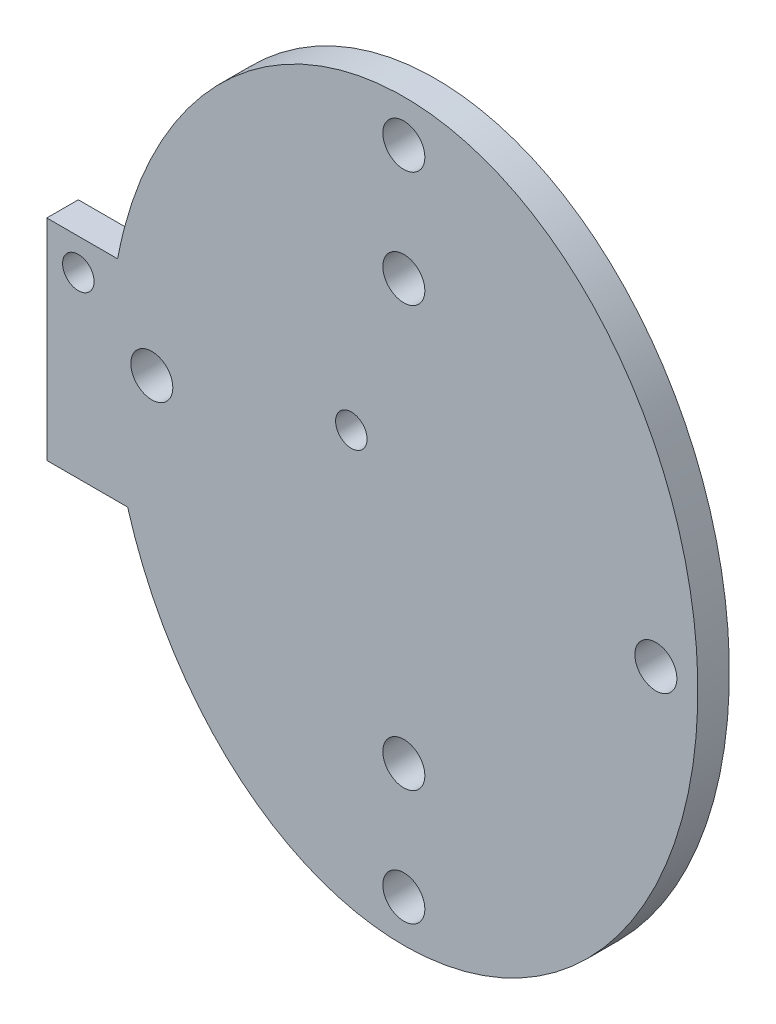
ISO-10303-21;
HEADER;
FILE_DESCRIPTION(('STEP AP214'),'2;1');
FILE_NAME('part.step','',(''),(''),'','','');
FILE_SCHEMA(('AUTOMOTIVE_DESIGN { 1 0 10303 214 1 1 1 1 }'));
ENDSEC;
DATA;
#1=APPLICATION_CONTEXT('core data for automotive mechanical design processes');
#2=APPLICATION_PROTOCOL_DEFINITION('international standard','automotive_design',2000,#1);
#3=PRODUCT_CONTEXT('',#1,'mechanical');
#4=PRODUCT('Part','Part','',(#3));
#5=PRODUCT_RELATED_PRODUCT_CATEGORY('part','',(#4));
#6=PRODUCT_DEFINITION_FORMATION('','',#4);
#7=PRODUCT_DEFINITION_CONTEXT('part definition',#1,'design');
#8=PRODUCT_DEFINITION('design','',#6,#7);
#9=PRODUCT_DEFINITION_SHAPE('','',#8);
#10=(LENGTH_UNIT() NAMED_UNIT(*) SI_UNIT(.MILLI.,.METRE.));
#11=(NAMED_UNIT(*) PLANE_ANGLE_UNIT() SI_UNIT($,.RADIAN.));
#12=(NAMED_UNIT(*) SI_UNIT($,.STERADIAN.) SOLID_ANGLE_UNIT());
#13=UNCERTAINTY_MEASURE_WITH_UNIT(LENGTH_MEASURE(1.E-05),#10,'distance_accuracy_value','');
#14=(GEOMETRIC_REPRESENTATION_CONTEXT(3) GLOBAL_UNCERTAINTY_ASSIGNED_CONTEXT((#13)) GLOBAL_UNIT_ASSIGNED_CONTEXT((#10,
#11,#12)) REPRESENTATION_CONTEXT('',''));
#15=CARTESIAN_POINT('',(0.,0.,0.));
#16=DIRECTION('',(0.,0.,1.));
#17=DIRECTION('',(1.,0.,0.));
#18=AXIS2_PLACEMENT_3D('',#15,#16,#17);
#19=CARTESIAN_POINT('',(0.,0.,3.));
#20=DIRECTION('',(0.,0.,1.));
#21=DIRECTION('',(1.,0.,0.));
#22=AXIS2_PLACEMENT_3D('',#19,#20,#21);
#23=PLANE('',#22);
#24=CARTESIAN_POINT('',(-31.,5.,3.));
#25=DIRECTION('',(0.,0.,1.));
#26=DIRECTION('',(1.,0.,0.));
#27=AXIS2_PLACEMENT_3D('',#24,#25,#26);
#28=CIRCLE('',#27,1.5);
#29=CARTESIAN_POINT('',(-29.5,5.,3.));
#30=VERTEX_POINT('',#29);
#31=EDGE_CURVE('E208',#30,#30,#28,.T.);
#32=ORIENTED_EDGE('',*,*,#31,.F.);
#33=EDGE_LOOP('',(#32));
#34=FACE_BOUND('',#33,.T.);
#35=CARTESIAN_POINT('',(-5.,5.,3.));
#36=DIRECTION('',(0.,0.,1.));
#37=DIRECTION('',(1.,0.,0.));
#38=AXIS2_PLACEMENT_3D('',#35,#36,#37);
#39=CIRCLE('',#38,1.5);
#40=CARTESIAN_POINT('',(-3.5,5.,3.));
#41=VERTEX_POINT('',#40);
#42=EDGE_CURVE('E100',#41,#41,#39,.T.);
#43=ORIENTED_EDGE('',*,*,#42,.F.);
#44=EDGE_LOOP('',(#43));
#45=FACE_BOUND('',#44,.T.);
#46=CARTESIAN_POINT('',(-24.,0.,3.));
#47=DIRECTION('',(0.,0.,1.));
#48=DIRECTION('',(1.,0.,0.));
#49=AXIS2_PLACEMENT_3D('',#46,#47,#48);
#50=CIRCLE('',#49,2.);
#51=CARTESIAN_POINT('',(-22.,0.,3.));
#52=VERTEX_POINT('',#51);
#53=EDGE_CURVE('E126',#52,#52,#50,.T.);
#54=ORIENTED_EDGE('',*,*,#53,.F.);
#55=EDGE_LOOP('',(#54));
#56=FACE_BOUND('',#55,.T.);
#57=CARTESIAN_POINT('',(0.,0.,3.));
#58=DIRECTION('',(0.,0.,1.));
#59=DIRECTION('',(0.,1.,0.));
#60=AXIS2_PLACEMENT_3D('',#57,#58,#59);
#61=ELLIPSE('',#60,35.,28.);
#62=CARTESIAN_POINT('',(-26.3028515564378,-12.,3.));
#63=VERTEX_POINT('',#62);
#64=CARTESIAN_POINT('',(-27.2587600598413,8.,3.));
#65=VERTEX_POINT('',#64);
#66=EDGE_CURVE('E52',#63,#65,#61,.T.);
#67=ORIENTED_EDGE('',*,*,#66,.T.);
#68=DIRECTION('',(1.,0.,0.));
#69=VECTOR('',#68,1.);
#70=CARTESIAN_POINT('',(-26.,8.,3.));
#71=LINE('',#70,#69);
#72=CARTESIAN_POINT('',(-34.,8.,3.));
#73=VERTEX_POINT('',#72);
#74=EDGE_CURVE('E90',#73,#65,#71,.T.);
#75=ORIENTED_EDGE('',*,*,#74,.F.);
#76=DIRECTION('',(0.,1.,0.));
#77=VECTOR('',#76,1.);
#78=CARTESIAN_POINT('',(-34.,8.,3.));
#79=LINE('',#78,#77);
#80=CARTESIAN_POINT('',(-34.,-12.,3.));
#81=VERTEX_POINT('',#80);
#82=EDGE_CURVE('E80',#81,#73,#79,.T.);
#83=ORIENTED_EDGE('',*,*,#82,.F.);
#84=DIRECTION('',(-1.,0.,0.));
#85=VECTOR('',#84,1.);
#86=CARTESIAN_POINT('',(-26.,-12.,3.));
#87=LINE('',#86,#85);
#88=EDGE_CURVE('E72',#63,#81,#87,.T.);
#89=ORIENTED_EDGE('',*,*,#88,.F.);
#90=EDGE_LOOP('',(#67,#75,#83,#89));
#91=FACE_BOUND('',#90,.T.);
#92=CARTESIAN_POINT('',(0.,-31.,3.));
#93=DIRECTION('',(0.,0.,1.));
#94=DIRECTION('',(1.,0.,0.));
#95=AXIS2_PLACEMENT_3D('',#92,#93,#94);
#96=CIRCLE('',#95,2.);
#97=CARTESIAN_POINT('',(2.,-31.,3.));
#98=VERTEX_POINT('',#97);
#99=EDGE_CURVE('E108',#98,#98,#96,.T.);
#100=ORIENTED_EDGE('',*,*,#99,.F.);
#101=EDGE_LOOP('',(#100));
#102=FACE_BOUND('',#101,.T.);
#103=CARTESIAN_POINT('',(0.,31.,3.));
#104=DIRECTION('',(0.,0.,1.));
#105=DIRECTION('',(1.,0.,0.));
#106=AXIS2_PLACEMENT_3D('',#103,#104,#105);
#107=CIRCLE('',#106,2.);
#108=CARTESIAN_POINT('',(2.,31.,3.));
#109=VERTEX_POINT('',#108);
#110=EDGE_CURVE('E114',#109,#109,#107,.T.);
#111=ORIENTED_EDGE('',*,*,#110,.F.);
#112=EDGE_LOOP('',(#111));
#113=FACE_BOUND('',#112,.T.);
#114=CARTESIAN_POINT('',(24.,0.,3.));
#115=DIRECTION('',(0.,0.,1.));
#116=DIRECTION('',(1.,0.,0.));
#117=AXIS2_PLACEMENT_3D('',#114,#115,#116);
#118=CIRCLE('',#117,2.);
#119=CARTESIAN_POINT('',(26.,0.,3.));
#120=VERTEX_POINT('',#119);
#121=EDGE_CURVE('E120',#120,#120,#118,.T.);
#122=ORIENTED_EDGE('',*,*,#121,.F.);
#123=EDGE_LOOP('',(#122));
#124=FACE_BOUND('',#123,.T.);
#125=CARTESIAN_POINT('',(0.,20.,3.));
#126=DIRECTION('',(0.,0.,1.));
#127=DIRECTION('',(1.,0.,0.));
#128=AXIS2_PLACEMENT_3D('',#125,#126,#127);
#129=CIRCLE('',#128,2.);
#130=CARTESIAN_POINT('',(2.,20.,3.));
#131=VERTEX_POINT('',#130);
#132=EDGE_CURVE('E136',#131,#131,#129,.T.);
#133=ORIENTED_EDGE('',*,*,#132,.F.);
#134=EDGE_LOOP('',(#133));
#135=FACE_BOUND('',#134,.T.);
#136=CARTESIAN_POINT('',(0.,-20.,3.));
#137=DIRECTION('',(0.,0.,1.));
#138=DIRECTION('',(1.,0.,0.));
#139=AXIS2_PLACEMENT_3D('',#136,#137,#138);
#140=CIRCLE('',#139,2.);
#141=CARTESIAN_POINT('',(2.,-20.,3.));
#142=VERTEX_POINT('',#141);
#143=EDGE_CURVE('E130',#142,#142,#140,.T.);
#144=ORIENTED_EDGE('',*,*,#143,.F.);
#145=EDGE_LOOP('',(#144));
#146=FACE_BOUND('',#145,.T.);
#147=ADVANCED_FACE('F32',(#34,#45,#56,#91,#102,#113,#124,#135,#146),#23,.T.);
#148=CARTESIAN_POINT('',(0.,0.,0.));
#149=DIRECTION('',(0.,0.,1.));
#150=DIRECTION('',(1.,0.,0.));
#151=AXIS2_PLACEMENT_3D('',#148,#149,#150);
#152=PLANE('',#151);
#153=CARTESIAN_POINT('',(-31.,5.,0.));
#154=DIRECTION('',(0.,0.,-1.));
#155=DIRECTION('',(-1.,0.,0.));
#156=AXIS2_PLACEMENT_3D('',#153,#154,#155);
#157=CIRCLE('',#156,1.5);
#158=CARTESIAN_POINT('',(-32.5,5.,0.));
#159=VERTEX_POINT('',#158);
#160=EDGE_CURVE('E211',#159,#159,#157,.T.);
#161=ORIENTED_EDGE('',*,*,#160,.F.);
#162=EDGE_LOOP('',(#161));
#163=FACE_BOUND('',#162,.T.);
#164=CARTESIAN_POINT('',(-5.,5.,0.));
#165=DIRECTION('',(0.,0.,-1.));
#166=DIRECTION('',(-1.,0.,0.));
#167=AXIS2_PLACEMENT_3D('',#164,#165,#166);
#168=CIRCLE('',#167,1.5);
#169=CARTESIAN_POINT('',(-6.5,5.,0.));
#170=VERTEX_POINT('',#169);
#171=EDGE_CURVE('E206',#170,#170,#168,.T.);
#172=ORIENTED_EDGE('',*,*,#171,.F.);
#173=EDGE_LOOP('',(#172));
#174=FACE_BOUND('',#173,.T.);
#175=CARTESIAN_POINT('',(-24.,0.,0.));
#176=DIRECTION('',(0.,0.,-1.));
#177=DIRECTION('',(-1.,0.,0.));
#178=AXIS2_PLACEMENT_3D('',#175,#176,#177);
#179=CIRCLE('',#178,2.);
#180=CARTESIAN_POINT('',(-26.,0.,0.));
#181=VERTEX_POINT('',#180);
#182=EDGE_CURVE('E123',#181,#181,#179,.T.);
#183=ORIENTED_EDGE('',*,*,#182,.F.);
#184=EDGE_LOOP('',(#183));
#185=FACE_BOUND('',#184,.T.);
#186=DIRECTION('',(1.,0.,0.));
#187=VECTOR('',#186,1.);
#188=CARTESIAN_POINT('',(-26.,8.,0.));
#189=LINE('',#188,#187);
#190=CARTESIAN_POINT('',(-34.,8.,0.));
#191=VERTEX_POINT('',#190);
#192=CARTESIAN_POINT('',(-27.2587600598413,8.,0.));
#193=VERTEX_POINT('',#192);
#194=EDGE_CURVE('E81',#191,#193,#189,.T.);
#195=ORIENTED_EDGE('',*,*,#194,.T.);
#196=CARTESIAN_POINT('',(0.,0.,0.));
#197=DIRECTION('',(0.,0.,1.));
#198=DIRECTION('',(0.,1.,0.));
#199=AXIS2_PLACEMENT_3D('',#196,#197,#198);
#200=ELLIPSE('',#199,35.,28.);
#201=CARTESIAN_POINT('',(-26.3028515564378,-12.,0.));
#202=VERTEX_POINT('',#201);
#203=EDGE_CURVE('E47',#202,#193,#200,.T.);
#204=ORIENTED_EDGE('',*,*,#203,.F.);
#205=DIRECTION('',(-1.,0.,0.));
#206=VECTOR('',#205,1.);
#207=CARTESIAN_POINT('',(-26.,-12.,0.));
#208=LINE('',#207,#206);
#209=CARTESIAN_POINT('',(-34.,-12.,0.));
#210=VERTEX_POINT('',#209);
#211=EDGE_CURVE('E98',#202,#210,#208,.T.);
#212=ORIENTED_EDGE('',*,*,#211,.T.);
#213=DIRECTION('',(0.,1.,0.));
#214=VECTOR('',#213,1.);
#215=CARTESIAN_POINT('',(-34.,8.,0.));
#216=LINE('',#215,#214);
#217=EDGE_CURVE('E88',#210,#191,#216,.T.);
#218=ORIENTED_EDGE('',*,*,#217,.T.);
#219=EDGE_LOOP('',(#195,#204,#212,#218));
#220=FACE_BOUND('',#219,.T.);
#221=CARTESIAN_POINT('',(0.,-31.,0.));
#222=DIRECTION('',(0.,0.,-1.));
#223=DIRECTION('',(-1.,0.,0.));
#224=AXIS2_PLACEMENT_3D('',#221,#222,#223);
#225=CIRCLE('',#224,2.);
#226=CARTESIAN_POINT('',(-2.,-31.,0.));
#227=VERTEX_POINT('',#226);
#228=EDGE_CURVE('E104',#227,#227,#225,.T.);
#229=ORIENTED_EDGE('',*,*,#228,.F.);
#230=EDGE_LOOP('',(#229));
#231=FACE_BOUND('',#230,.T.);
#232=CARTESIAN_POINT('',(0.,31.,0.));
#233=DIRECTION('',(0.,0.,-1.));
#234=DIRECTION('',(-1.,0.,0.));
#235=AXIS2_PLACEMENT_3D('',#232,#233,#234);
#236=CIRCLE('',#235,2.);
#237=CARTESIAN_POINT('',(-2.,31.,0.));
#238=VERTEX_POINT('',#237);
#239=EDGE_CURVE('E111',#238,#238,#236,.T.);
#240=ORIENTED_EDGE('',*,*,#239,.F.);
#241=EDGE_LOOP('',(#240));
#242=FACE_BOUND('',#241,.T.);
#243=CARTESIAN_POINT('',(24.,0.,0.));
#244=DIRECTION('',(0.,0.,-1.));
#245=DIRECTION('',(-1.,0.,0.));
#246=AXIS2_PLACEMENT_3D('',#243,#244,#245);
#247=CIRCLE('',#246,2.);
#248=CARTESIAN_POINT('',(22.,0.,0.));
#249=VERTEX_POINT('',#248);
#250=EDGE_CURVE('E117',#249,#249,#247,.T.);
#251=ORIENTED_EDGE('',*,*,#250,.F.);
#252=EDGE_LOOP('',(#251));
#253=FACE_BOUND('',#252,.T.);
#254=CARTESIAN_POINT('',(0.,20.,0.));
#255=DIRECTION('',(0.,0.,1.));
#256=DIRECTION('',(1.,0.,0.));
#257=AXIS2_PLACEMENT_3D('',#254,#255,#256);
#258=CIRCLE('',#257,2.);
#259=CARTESIAN_POINT('',(2.,20.,0.));
#260=VERTEX_POINT('',#259);
#261=EDGE_CURVE('E133',#260,#260,#258,.T.);
#262=ORIENTED_EDGE('',*,*,#261,.T.);
#263=EDGE_LOOP('',(#262));
#264=FACE_BOUND('',#263,.T.);
#265=CARTESIAN_POINT('',(0.,-20.,0.));
#266=DIRECTION('',(0.,0.,1.));
#267=DIRECTION('',(1.,0.,0.));
#268=AXIS2_PLACEMENT_3D('',#265,#266,#267);
#269=CIRCLE('',#268,2.);
#270=CARTESIAN_POINT('',(2.,-20.,0.));
#271=VERTEX_POINT('',#270);
#272=EDGE_CURVE('E129',#271,#271,#269,.T.);
#273=ORIENTED_EDGE('',*,*,#272,.T.);
#274=EDGE_LOOP('',(#273));
#275=FACE_BOUND('',#274,.T.);
#276=ADVANCED_FACE('F143',(#163,#174,#185,#220,#231,#242,#253,#264,#275),#152,.F.);
#277=DIRECTION('',(0.,0.,-1.));
#278=VECTOR('',#277,1.);
#279=SURFACE_OF_LINEAR_EXTRUSION('',#61,#278);
#280=ORIENTED_EDGE('',*,*,#203,.T.);
#281=DIRECTION('',(0.,0.,-1.));
#282=VECTOR('',#281,1.);
#283=CARTESIAN_POINT('',(-27.2587600598413,8.,3.));
#284=LINE('',#283,#282);
#285=EDGE_CURVE('E11',#193,#65,#284,.F.);
#286=ORIENTED_EDGE('',*,*,#285,.T.);
#287=ORIENTED_EDGE('',*,*,#66,.F.);
#288=DIRECTION('',(0.,0.,-1.));
#289=VECTOR('',#288,1.);
#290=CARTESIAN_POINT('',(-26.3028515564378,-12.,3.));
#291=LINE('',#290,#289);
#292=EDGE_CURVE('E41',#63,#202,#291,.T.);
#293=ORIENTED_EDGE('',*,*,#292,.T.);
#294=EDGE_LOOP('',(#280,#286,#287,#293));
#295=FACE_BOUND('',#294,.T.);
#296=ADVANCED_FACE('F34',(#295),#279,.F.);
#297=CARTESIAN_POINT('',(0.,20.,3.));
#298=DIRECTION('',(0.,0.,-1.));
#299=DIRECTION('',(-1.,0.,0.));
#300=AXIS2_PLACEMENT_3D('',#297,#298,#299);
#301=CYLINDRICAL_SURFACE('',#300,2.);
#302=ORIENTED_EDGE('',*,*,#132,.T.);
#303=EDGE_LOOP('',(#302));
#304=FACE_BOUND('',#303,.T.);
#305=ORIENTED_EDGE('',*,*,#261,.F.);
#306=EDGE_LOOP('',(#305));
#307=FACE_BOUND('',#306,.T.);
#308=ADVANCED_FACE('F171',(#304,#307),#301,.F.);
#309=CARTESIAN_POINT('',(0.,-20.,3.));
#310=DIRECTION('',(0.,0.,-1.));
#311=DIRECTION('',(-1.,0.,0.));
#312=AXIS2_PLACEMENT_3D('',#309,#310,#311);
#313=CYLINDRICAL_SURFACE('',#312,2.);
#314=ORIENTED_EDGE('',*,*,#143,.T.);
#315=EDGE_LOOP('',(#314));
#316=FACE_BOUND('',#315,.T.);
#317=ORIENTED_EDGE('',*,*,#272,.F.);
#318=EDGE_LOOP('',(#317));
#319=FACE_BOUND('',#318,.T.);
#320=ADVANCED_FACE('F174',(#316,#319),#313,.F.);
#321=CARTESIAN_POINT('',(-24.,0.,10.));
#322=DIRECTION('',(0.,0.,-1.));
#323=DIRECTION('',(-1.,0.,0.));
#324=AXIS2_PLACEMENT_3D('',#321,#322,#323);
#325=CYLINDRICAL_SURFACE('',#324,2.);
#326=ORIENTED_EDGE('',*,*,#53,.T.);
#327=EDGE_LOOP('',(#326));
#328=FACE_BOUND('',#327,.T.);
#329=ORIENTED_EDGE('',*,*,#182,.T.);
#330=EDGE_LOOP('',(#329));
#331=FACE_BOUND('',#330,.T.);
#332=ADVANCED_FACE('F178',(#328,#331),#325,.F.);
#333=CARTESIAN_POINT('',(24.,0.,10.));
#334=DIRECTION('',(0.,0.,-1.));
#335=DIRECTION('',(-1.,0.,0.));
#336=AXIS2_PLACEMENT_3D('',#333,#334,#335);
#337=CYLINDRICAL_SURFACE('',#336,2.);
#338=ORIENTED_EDGE('',*,*,#121,.T.);
#339=EDGE_LOOP('',(#338));
#340=FACE_BOUND('',#339,.T.);
#341=ORIENTED_EDGE('',*,*,#250,.T.);
#342=EDGE_LOOP('',(#341));
#343=FACE_BOUND('',#342,.T.);
#344=ADVANCED_FACE('F182',(#340,#343),#337,.F.);
#345=CARTESIAN_POINT('',(0.,31.,10.));
#346=DIRECTION('',(0.,0.,-1.));
#347=DIRECTION('',(-1.,0.,0.));
#348=AXIS2_PLACEMENT_3D('',#345,#346,#347);
#349=CYLINDRICAL_SURFACE('',#348,2.);
#350=ORIENTED_EDGE('',*,*,#110,.T.);
#351=EDGE_LOOP('',(#350));
#352=FACE_BOUND('',#351,.T.);
#353=ORIENTED_EDGE('',*,*,#239,.T.);
#354=EDGE_LOOP('',(#353));
#355=FACE_BOUND('',#354,.T.);
#356=ADVANCED_FACE('F156',(#352,#355),#349,.F.);
#357=CARTESIAN_POINT('',(0.,-31.,10.));
#358=DIRECTION('',(0.,0.,-1.));
#359=DIRECTION('',(-1.,0.,0.));
#360=AXIS2_PLACEMENT_3D('',#357,#358,#359);
#361=CYLINDRICAL_SURFACE('',#360,2.);
#362=ORIENTED_EDGE('',*,*,#99,.T.);
#363=EDGE_LOOP('',(#362));
#364=FACE_BOUND('',#363,.T.);
#365=ORIENTED_EDGE('',*,*,#228,.T.);
#366=EDGE_LOOP('',(#365));
#367=FACE_BOUND('',#366,.T.);
#368=ADVANCED_FACE('F149',(#364,#367),#361,.F.);
#369=CARTESIAN_POINT('',(-26.,8.,3.));
#370=DIRECTION('',(0.,1.,0.));
#371=DIRECTION('',(0.,0.,1.));
#372=AXIS2_PLACEMENT_3D('',#369,#370,#371);
#373=PLANE('',#372);
#374=ORIENTED_EDGE('',*,*,#285,.F.);
#375=ORIENTED_EDGE('',*,*,#194,.F.);
#376=DIRECTION('',(0.,0.,-1.));
#377=VECTOR('',#376,1.);
#378=CARTESIAN_POINT('',(-34.,8.,3.));
#379=LINE('',#378,#377);
#380=EDGE_CURVE('E89',#73,#191,#379,.T.);
#381=ORIENTED_EDGE('',*,*,#380,.F.);
#382=ORIENTED_EDGE('',*,*,#74,.T.);
#383=EDGE_LOOP('',(#374,#375,#381,#382));
#384=FACE_BOUND('',#383,.T.);
#385=ADVANCED_FACE('F147',(#384),#373,.T.);
#386=CARTESIAN_POINT('',(-26.,-12.,3.));
#387=DIRECTION('',(0.,-1.,0.));
#388=DIRECTION('',(0.,0.,-1.));
#389=AXIS2_PLACEMENT_3D('',#386,#387,#388);
#390=PLANE('',#389);
#391=ORIENTED_EDGE('',*,*,#292,.F.);
#392=ORIENTED_EDGE('',*,*,#88,.T.);
#393=DIRECTION('',(0.,0.,-1.));
#394=VECTOR('',#393,1.);
#395=CARTESIAN_POINT('',(-34.,-12.,3.));
#396=LINE('',#395,#394);
#397=EDGE_CURVE('E76',#81,#210,#396,.T.);
#398=ORIENTED_EDGE('',*,*,#397,.T.);
#399=ORIENTED_EDGE('',*,*,#211,.F.);
#400=EDGE_LOOP('',(#391,#392,#398,#399));
#401=FACE_BOUND('',#400,.T.);
#402=ADVANCED_FACE('F74',(#401),#390,.T.);
#403=CARTESIAN_POINT('',(-34.,8.,3.));
#404=DIRECTION('',(-1.,0.,0.));
#405=DIRECTION('',(0.,-1.,0.));
#406=AXIS2_PLACEMENT_3D('',#403,#404,#405);
#407=PLANE('',#406);
#408=ORIENTED_EDGE('',*,*,#217,.F.);
#409=ORIENTED_EDGE('',*,*,#397,.F.);
#410=ORIENTED_EDGE('',*,*,#82,.T.);
#411=ORIENTED_EDGE('',*,*,#380,.T.);
#412=EDGE_LOOP('',(#408,#409,#410,#411));
#413=FACE_BOUND('',#412,.T.);
#414=ADVANCED_FACE('F85',(#413),#407,.T.);
#415=CARTESIAN_POINT('',(-5.,5.,10.));
#416=DIRECTION('',(0.,0.,-1.));
#417=DIRECTION('',(-1.,0.,0.));
#418=AXIS2_PLACEMENT_3D('',#415,#416,#417);
#419=CYLINDRICAL_SURFACE('',#418,1.5);
#420=ORIENTED_EDGE('',*,*,#42,.T.);
#421=EDGE_LOOP('',(#420));
#422=FACE_BOUND('',#421,.T.);
#423=ORIENTED_EDGE('',*,*,#171,.T.);
#424=EDGE_LOOP('',(#423));
#425=FACE_BOUND('',#424,.T.);
#426=ADVANCED_FACE('F190',(#422,#425),#419,.F.);
#427=CARTESIAN_POINT('',(-31.,5.,10.));
#428=DIRECTION('',(0.,0.,-1.));
#429=DIRECTION('',(-1.,0.,0.));
#430=AXIS2_PLACEMENT_3D('',#427,#428,#429);
#431=CYLINDRICAL_SURFACE('',#430,1.5);
#432=ORIENTED_EDGE('',*,*,#31,.T.);
#433=EDGE_LOOP('',(#432));
#434=FACE_BOUND('',#433,.T.);
#435=ORIENTED_EDGE('',*,*,#160,.T.);
#436=EDGE_LOOP('',(#435));
#437=FACE_BOUND('',#436,.T.);
#438=ADVANCED_FACE('F194',(#434,#437),#431,.F.);
#439=CLOSED_SHELL('',(#147,#276,#296,#308,#320,#332,#344,#356,#368,#385,#402,#414,#426,#438));
#440=MANIFOLD_SOLID_BREP('B2',#439);
#441=ADVANCED_BREP_SHAPE_REPRESENTATION('',(#18,#440),#14);
#442=SHAPE_DEFINITION_REPRESENTATION(#9,#441);
ENDSEC;
END-ISO-10303-21;
